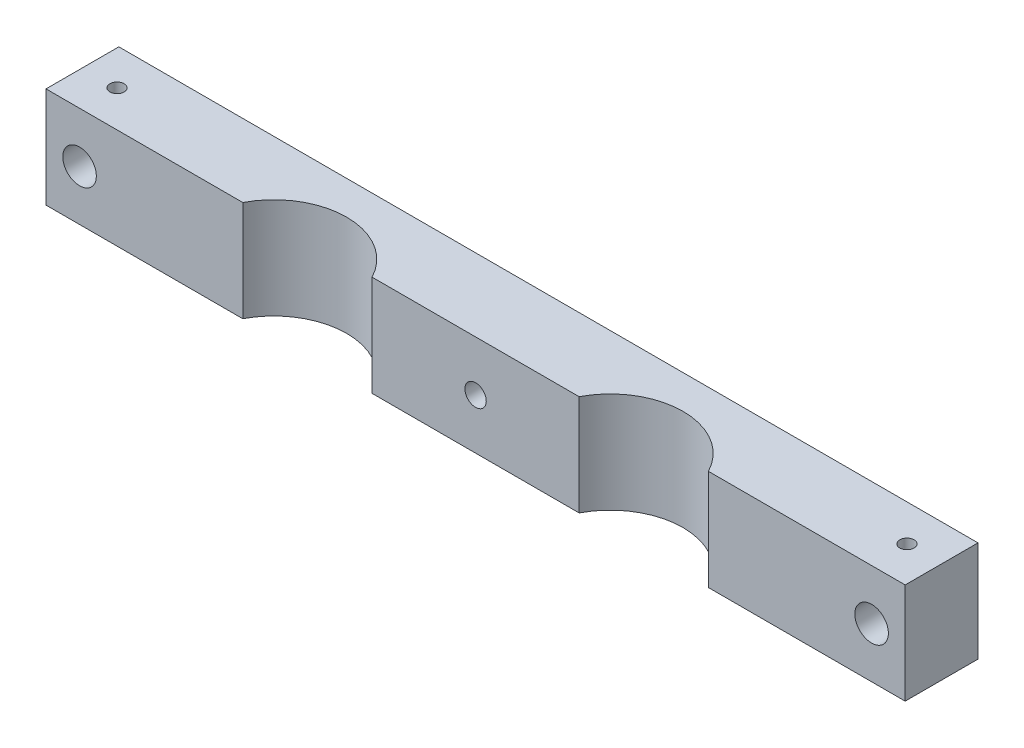
ISO-10303-21;
HEADER;
FILE_DESCRIPTION(('STEP AP214'),'2;1');
FILE_NAME('part.step','',(''),(''),'','','');
FILE_SCHEMA(('AUTOMOTIVE_DESIGN { 1 0 10303 214 1 1 1 1 }'));
ENDSEC;
DATA;
#1=APPLICATION_CONTEXT('core data for automotive mechanical design processes');
#2=APPLICATION_PROTOCOL_DEFINITION('international standard','automotive_design',2000,#1);
#3=PRODUCT_CONTEXT('',#1,'mechanical');
#4=PRODUCT('Part','Part','',(#3));
#5=PRODUCT_RELATED_PRODUCT_CATEGORY('part','',(#4));
#6=PRODUCT_DEFINITION_FORMATION('','',#4);
#7=PRODUCT_DEFINITION_CONTEXT('part definition',#1,'design');
#8=PRODUCT_DEFINITION('design','',#6,#7);
#9=PRODUCT_DEFINITION_SHAPE('','',#8);
#10=(LENGTH_UNIT() NAMED_UNIT(*) SI_UNIT(.MILLI.,.METRE.));
#11=(NAMED_UNIT(*) PLANE_ANGLE_UNIT() SI_UNIT($,.RADIAN.));
#12=(NAMED_UNIT(*) SI_UNIT($,.STERADIAN.) SOLID_ANGLE_UNIT());
#13=UNCERTAINTY_MEASURE_WITH_UNIT(LENGTH_MEASURE(1.E-05),#10,'distance_accuracy_value','');
#14=(GEOMETRIC_REPRESENTATION_CONTEXT(3) GLOBAL_UNCERTAINTY_ASSIGNED_CONTEXT((#13)) GLOBAL_UNIT_ASSIGNED_CONTEXT((#10,
#11,#12)) REPRESENTATION_CONTEXT('',''));
#15=CARTESIAN_POINT('',(0.,0.,0.));
#16=DIRECTION('',(0.,0.,1.));
#17=DIRECTION('',(1.,0.,0.));
#18=AXIS2_PLACEMENT_3D('',#15,#16,#17);
#19=CARTESIAN_POINT('',(31.81985,19.05,6.35));
#20=DIRECTION('',(0.,-1.,0.));
#21=DIRECTION('',(0.,0.,-1.));
#22=AXIS2_PLACEMENT_3D('',#19,#20,#21);
#23=CYLINDRICAL_SURFACE('',#22,13.7795);
#24=CARTESIAN_POINT('',(31.81985,0.,6.35));
#25=DIRECTION('',(0.,1.,0.));
#26=DIRECTION('',(0.,0.,1.));
#27=AXIS2_PLACEMENT_3D('',#24,#25,#26);
#28=CIRCLE('',#27,13.7795);
#29=CARTESIAN_POINT('',(44.0490004304265,0.,0.));
#30=VERTEX_POINT('',#29);
#31=CARTESIAN_POINT('',(19.5906995695735,0.,0.));
#32=VERTEX_POINT('',#31);
#33=EDGE_CURVE('E131',#30,#32,#28,.T.);
#34=ORIENTED_EDGE('',*,*,#33,.F.);
#35=DIRECTION('',(0.,-1.,0.));
#36=VECTOR('',#35,1.);
#37=CARTESIAN_POINT('',(44.0490004304265,19.05,0.));
#38=LINE('',#37,#36);
#39=CARTESIAN_POINT('',(44.0490004304265,19.05,0.));
#40=VERTEX_POINT('',#39);
#41=EDGE_CURVE('E11',#40,#30,#38,.T.);
#42=ORIENTED_EDGE('',*,*,#41,.F.);
#43=CARTESIAN_POINT('',(31.81985,19.05,6.35));
#44=DIRECTION('',(0.,1.,0.));
#45=DIRECTION('',(0.,0.,1.));
#46=AXIS2_PLACEMENT_3D('',#43,#44,#45);
#47=CIRCLE('',#46,13.7795);
#48=CARTESIAN_POINT('',(19.5906995695735,19.05,0.));
#49=VERTEX_POINT('',#48);
#50=EDGE_CURVE('E151',#40,#49,#47,.T.);
#51=ORIENTED_EDGE('',*,*,#50,.T.);
#52=DIRECTION('',(0.,-1.,0.));
#53=VECTOR('',#52,1.);
#54=CARTESIAN_POINT('',(19.5906995695735,19.05,0.));
#55=LINE('',#54,#53);
#56=EDGE_CURVE('E87',#49,#32,#55,.T.);
#57=ORIENTED_EDGE('',*,*,#56,.T.);
#58=EDGE_LOOP('',(#34,#42,#51,#57));
#59=FACE_BOUND('',#58,.T.);
#60=ADVANCED_FACE('F37',(#59),#23,.F.);
#61=CARTESIAN_POINT('',(0.,19.05,0.));
#62=DIRECTION('',(0.,0.,-1.));
#63=DIRECTION('',(-1.,0.,0.));
#64=AXIS2_PLACEMENT_3D('',#61,#62,#63);
#65=PLANE('',#64);
#66=CARTESIAN_POINT('',(74.93,9.525,0.));
#67=DIRECTION('',(0.,0.,1.));
#68=DIRECTION('',(1.,0.,0.));
#69=AXIS2_PLACEMENT_3D('',#66,#67,#68);
#70=CIRCLE('',#69,3.175);
#71=CARTESIAN_POINT('',(78.105,9.525,0.));
#72=VERTEX_POINT('',#71);
#73=EDGE_CURVE('E220',#72,#72,#70,.T.);
#74=ORIENTED_EDGE('',*,*,#73,.F.);
#75=EDGE_LOOP('',(#74));
#76=FACE_BOUND('',#75,.T.);
#77=DIRECTION('',(1.,0.,0.));
#78=VECTOR('',#77,1.);
#79=CARTESIAN_POINT('',(0.,0.,0.));
#80=LINE('',#79,#78);
#81=CARTESIAN_POINT('',(81.28,0.,0.));
#82=VERTEX_POINT('',#81);
#83=EDGE_CURVE('E134',#30,#82,#80,.T.);
#84=ORIENTED_EDGE('',*,*,#83,.T.);
#85=DIRECTION('',(0.,-1.,0.));
#86=VECTOR('',#85,1.);
#87=CARTESIAN_POINT('',(81.28,19.05,0.));
#88=LINE('',#87,#86);
#89=CARTESIAN_POINT('',(81.28,19.05,0.));
#90=VERTEX_POINT('',#89);
#91=EDGE_CURVE('E45',#90,#82,#88,.T.);
#92=ORIENTED_EDGE('',*,*,#91,.F.);
#93=DIRECTION('',(1.,0.,0.));
#94=VECTOR('',#93,1.);
#95=CARTESIAN_POINT('',(0.,19.05,0.));
#96=LINE('',#95,#94);
#97=EDGE_CURVE('E177',#40,#90,#96,.T.);
#98=ORIENTED_EDGE('',*,*,#97,.F.);
#99=ORIENTED_EDGE('',*,*,#41,.T.);
#100=EDGE_LOOP('',(#84,#92,#98,#99));
#101=FACE_BOUND('',#100,.T.);
#102=ADVANCED_FACE('F245',(#76,#101),#65,.F.);
#103=CARTESIAN_POINT('',(81.28,19.05,0.));
#104=DIRECTION('',(-1.,0.,0.));
#105=DIRECTION('',(0.,0.,1.));
#106=AXIS2_PLACEMENT_3D('',#103,#104,#105);
#107=PLANE('',#106);
#108=DIRECTION('',(0.,0.,-1.));
#109=VECTOR('',#108,1.);
#110=CARTESIAN_POINT('',(81.28,0.,0.));
#111=LINE('',#110,#109);
#112=CARTESIAN_POINT('',(81.28,0.,-13.7795));
#113=VERTEX_POINT('',#112);
#114=EDGE_CURVE('E137',#82,#113,#111,.T.);
#115=ORIENTED_EDGE('',*,*,#114,.T.);
#116=DIRECTION('',(0.,-1.,0.));
#117=VECTOR('',#116,1.);
#118=CARTESIAN_POINT('',(81.28,19.05,-13.7795));
#119=LINE('',#118,#117);
#120=CARTESIAN_POINT('',(81.28,19.05,-13.7795));
#121=VERTEX_POINT('',#120);
#122=EDGE_CURVE('E157',#121,#113,#119,.T.);
#123=ORIENTED_EDGE('',*,*,#122,.F.);
#124=DIRECTION('',(0.,0.,-1.));
#125=VECTOR('',#124,1.);
#126=CARTESIAN_POINT('',(81.28,19.05,0.));
#127=LINE('',#126,#125);
#128=EDGE_CURVE('E165',#90,#121,#127,.T.);
#129=ORIENTED_EDGE('',*,*,#128,.F.);
#130=ORIENTED_EDGE('',*,*,#91,.T.);
#131=EDGE_LOOP('',(#115,#123,#129,#130));
#132=FACE_BOUND('',#131,.T.);
#133=ADVANCED_FACE('F163',(#132),#107,.F.);
#134=CARTESIAN_POINT('',(0.,19.05,-13.7795));
#135=DIRECTION('',(0.,0.,-1.));
#136=DIRECTION('',(-1.,0.,0.));
#137=AXIS2_PLACEMENT_3D('',#134,#135,#136);
#138=PLANE('',#137);
#139=CARTESIAN_POINT('',(0.,9.525,-13.7795));
#140=DIRECTION('',(0.,0.,-1.));
#141=DIRECTION('',(-1.,0.,0.));
#142=AXIS2_PLACEMENT_3D('',#139,#140,#141);
#143=CIRCLE('',#142,2.0193);
#144=CARTESIAN_POINT('',(-2.01929999999998,9.525,-13.7795));
#145=VERTEX_POINT('',#144);
#146=EDGE_CURVE('E373',#145,#145,#143,.T.);
#147=ORIENTED_EDGE('',*,*,#146,.F.);
#148=EDGE_LOOP('',(#147));
#149=FACE_BOUND('',#148,.T.);
#150=CARTESIAN_POINT('',(74.93,9.525,-13.7795));
#151=DIRECTION('',(0.,0.,1.));
#152=DIRECTION('',(1.,0.,0.));
#153=AXIS2_PLACEMENT_3D('',#150,#151,#152);
#154=CIRCLE('',#153,3.175);
#155=CARTESIAN_POINT('',(78.105,9.525,-13.7795));
#156=VERTEX_POINT('',#155);
#157=EDGE_CURVE('E224',#156,#156,#154,.T.);
#158=ORIENTED_EDGE('',*,*,#157,.T.);
#159=EDGE_LOOP('',(#158));
#160=FACE_BOUND('',#159,.T.);
#161=CARTESIAN_POINT('',(-74.93,9.525,-13.7795));
#162=DIRECTION('',(0.,0.,1.));
#163=DIRECTION('',(1.,0.,0.));
#164=AXIS2_PLACEMENT_3D('',#161,#162,#163);
#165=CIRCLE('',#164,3.175);
#166=CARTESIAN_POINT('',(-71.755,9.525,-13.7795));
#167=VERTEX_POINT('',#166);
#168=EDGE_CURVE('E135',#167,#167,#165,.T.);
#169=ORIENTED_EDGE('',*,*,#168,.T.);
#170=EDGE_LOOP('',(#169));
#171=FACE_BOUND('',#170,.T.);
#172=DIRECTION('',(1.,0.,0.));
#173=VECTOR('',#172,1.);
#174=CARTESIAN_POINT('',(0.,0.,-13.7795));
#175=LINE('',#174,#173);
#176=CARTESIAN_POINT('',(-81.28,0.,-13.7795));
#177=VERTEX_POINT('',#176);
#178=EDGE_CURVE('E140',#177,#113,#175,.T.);
#179=ORIENTED_EDGE('',*,*,#178,.F.);
#180=DIRECTION('',(0.,-1.,0.));
#181=VECTOR('',#180,1.);
#182=CARTESIAN_POINT('',(-81.28,19.05,-13.7795));
#183=LINE('',#182,#181);
#184=CARTESIAN_POINT('',(-81.28,19.05,-13.7795));
#185=VERTEX_POINT('',#184);
#186=EDGE_CURVE('E155',#185,#177,#183,.T.);
#187=ORIENTED_EDGE('',*,*,#186,.F.);
#188=DIRECTION('',(1.,0.,0.));
#189=VECTOR('',#188,1.);
#190=CARTESIAN_POINT('',(0.,19.05,-13.7795));
#191=LINE('',#190,#189);
#192=EDGE_CURVE('E175',#185,#121,#191,.T.);
#193=ORIENTED_EDGE('',*,*,#192,.T.);
#194=ORIENTED_EDGE('',*,*,#122,.T.);
#195=EDGE_LOOP('',(#179,#187,#193,#194));
#196=FACE_BOUND('',#195,.T.);
#197=ADVANCED_FACE('F173',(#149,#160,#171,#196),#138,.T.);
#198=CARTESIAN_POINT('',(-81.28,19.05,0.));
#199=DIRECTION('',(-1.,0.,0.));
#200=DIRECTION('',(0.,0.,1.));
#201=AXIS2_PLACEMENT_3D('',#198,#199,#200);
#202=PLANE('',#201);
#203=DIRECTION('',(0.,0.,-1.));
#204=VECTOR('',#203,1.);
#205=CARTESIAN_POINT('',(-81.28,0.,0.));
#206=LINE('',#205,#204);
#207=CARTESIAN_POINT('',(-81.28,0.,0.));
#208=VERTEX_POINT('',#207);
#209=EDGE_CURVE('E143',#208,#177,#206,.T.);
#210=ORIENTED_EDGE('',*,*,#209,.F.);
#211=DIRECTION('',(0.,-1.,0.));
#212=VECTOR('',#211,1.);
#213=CARTESIAN_POINT('',(-81.28,19.05,0.));
#214=LINE('',#213,#212);
#215=CARTESIAN_POINT('',(-81.28,19.05,0.));
#216=VERTEX_POINT('',#215);
#217=EDGE_CURVE('E117',#216,#208,#214,.T.);
#218=ORIENTED_EDGE('',*,*,#217,.F.);
#219=DIRECTION('',(0.,0.,-1.));
#220=VECTOR('',#219,1.);
#221=CARTESIAN_POINT('',(-81.28,19.05,0.));
#222=LINE('',#221,#220);
#223=EDGE_CURVE('E124',#216,#185,#222,.T.);
#224=ORIENTED_EDGE('',*,*,#223,.T.);
#225=ORIENTED_EDGE('',*,*,#186,.T.);
#226=EDGE_LOOP('',(#210,#218,#224,#225));
#227=FACE_BOUND('',#226,.T.);
#228=ADVANCED_FACE('F258',(#227),#202,.T.);
#229=CARTESIAN_POINT('',(0.,19.05,0.));
#230=DIRECTION('',(0.,0.,1.));
#231=DIRECTION('',(1.,0.,0.));
#232=AXIS2_PLACEMENT_3D('',#229,#230,#231);
#233=PLANE('',#232);
#234=CARTESIAN_POINT('',(-74.93,9.525,0.));
#235=DIRECTION('',(0.,0.,1.));
#236=DIRECTION('',(1.,0.,0.));
#237=AXIS2_PLACEMENT_3D('',#234,#235,#236);
#238=CIRCLE('',#237,3.175);
#239=CARTESIAN_POINT('',(-71.755,9.525,0.));
#240=VERTEX_POINT('',#239);
#241=EDGE_CURVE('E184',#240,#240,#238,.T.);
#242=ORIENTED_EDGE('',*,*,#241,.F.);
#243=EDGE_LOOP('',(#242));
#244=FACE_BOUND('',#243,.T.);
#245=DIRECTION('',(-1.,0.,0.));
#246=VECTOR('',#245,1.);
#247=CARTESIAN_POINT('',(0.,0.,0.));
#248=LINE('',#247,#246);
#249=CARTESIAN_POINT('',(-44.0490004304265,0.,0.));
#250=VERTEX_POINT('',#249);
#251=EDGE_CURVE('E112',#250,#208,#248,.T.);
#252=ORIENTED_EDGE('',*,*,#251,.F.);
#253=DIRECTION('',(0.,-1.,0.));
#254=VECTOR('',#253,1.);
#255=CARTESIAN_POINT('',(-44.0490004304265,19.05,0.));
#256=LINE('',#255,#254);
#257=CARTESIAN_POINT('',(-44.0490004304265,19.05,0.));
#258=VERTEX_POINT('',#257);
#259=EDGE_CURVE('E107',#258,#250,#256,.T.);
#260=ORIENTED_EDGE('',*,*,#259,.F.);
#261=DIRECTION('',(-1.,0.,0.));
#262=VECTOR('',#261,1.);
#263=CARTESIAN_POINT('',(0.,19.05,0.));
#264=LINE('',#263,#262);
#265=EDGE_CURVE('E110',#258,#216,#264,.T.);
#266=ORIENTED_EDGE('',*,*,#265,.T.);
#267=ORIENTED_EDGE('',*,*,#217,.T.);
#268=EDGE_LOOP('',(#252,#260,#266,#267));
#269=FACE_BOUND('',#268,.T.);
#270=ADVANCED_FACE('F109',(#244,#269),#233,.T.);
#271=CARTESIAN_POINT('',(-31.81985,19.05,6.35));
#272=DIRECTION('',(0.,-1.,0.));
#273=DIRECTION('',(0.,0.,-1.));
#274=AXIS2_PLACEMENT_3D('',#271,#272,#273);
#275=CYLINDRICAL_SURFACE('',#274,13.7795);
#276=CARTESIAN_POINT('',(-31.81985,0.,6.35));
#277=DIRECTION('',(0.,1.,0.));
#278=DIRECTION('',(0.,0.,1.));
#279=AXIS2_PLACEMENT_3D('',#276,#277,#278);
#280=CIRCLE('',#279,13.7795);
#281=CARTESIAN_POINT('',(-19.5906995695735,0.,0.));
#282=VERTEX_POINT('',#281);
#283=EDGE_CURVE('E147',#282,#250,#280,.T.);
#284=ORIENTED_EDGE('',*,*,#283,.F.);
#285=DIRECTION('',(0.,-1.,0.));
#286=VECTOR('',#285,1.);
#287=CARTESIAN_POINT('',(-19.5906995695735,19.05,0.));
#288=LINE('',#287,#286);
#289=CARTESIAN_POINT('',(-19.5906995695735,19.05,0.));
#290=VERTEX_POINT('',#289);
#291=EDGE_CURVE('E80',#290,#282,#288,.T.);
#292=ORIENTED_EDGE('',*,*,#291,.F.);
#293=CARTESIAN_POINT('',(-31.81985,19.05,6.35));
#294=DIRECTION('',(0.,1.,0.));
#295=DIRECTION('',(0.,0.,1.));
#296=AXIS2_PLACEMENT_3D('',#293,#294,#295);
#297=CIRCLE('',#296,13.7795);
#298=EDGE_CURVE('E121',#290,#258,#297,.T.);
#299=ORIENTED_EDGE('',*,*,#298,.T.);
#300=ORIENTED_EDGE('',*,*,#259,.T.);
#301=EDGE_LOOP('',(#284,#292,#299,#300));
#302=FACE_BOUND('',#301,.T.);
#303=ADVANCED_FACE('F126',(#302),#275,.F.);
#304=CARTESIAN_POINT('',(0.,19.05,0.));
#305=DIRECTION('',(0.,0.,-1.));
#306=DIRECTION('',(-1.,0.,0.));
#307=AXIS2_PLACEMENT_3D('',#304,#305,#306);
#308=PLANE('',#307);
#309=CARTESIAN_POINT('',(0.,9.525,0.));
#310=DIRECTION('',(0.,0.,1.));
#311=DIRECTION('',(1.,0.,0.));
#312=AXIS2_PLACEMENT_3D('',#309,#310,#311);
#313=CIRCLE('',#312,2.0193);
#314=CARTESIAN_POINT('',(2.01930000000001,9.525,0.));
#315=VERTEX_POINT('',#314);
#316=EDGE_CURVE('E375',#315,#315,#313,.T.);
#317=ORIENTED_EDGE('',*,*,#316,.F.);
#318=EDGE_LOOP('',(#317));
#319=FACE_BOUND('',#318,.T.);
#320=DIRECTION('',(1.,0.,0.));
#321=VECTOR('',#320,1.);
#322=CARTESIAN_POINT('',(0.,0.,0.));
#323=LINE('',#322,#321);
#324=EDGE_CURVE('E149',#282,#32,#323,.T.);
#325=ORIENTED_EDGE('',*,*,#324,.T.);
#326=ORIENTED_EDGE('',*,*,#56,.F.);
#327=DIRECTION('',(1.,0.,0.));
#328=VECTOR('',#327,1.);
#329=CARTESIAN_POINT('',(0.,19.05,0.));
#330=LINE('',#329,#328);
#331=EDGE_CURVE('E53',#290,#49,#330,.T.);
#332=ORIENTED_EDGE('',*,*,#331,.F.);
#333=ORIENTED_EDGE('',*,*,#291,.T.);
#334=EDGE_LOOP('',(#325,#326,#332,#333));
#335=FACE_BOUND('',#334,.T.);
#336=ADVANCED_FACE('F233',(#319,#335),#308,.F.);
#337=CARTESIAN_POINT('',(0.,19.05,0.));
#338=DIRECTION('',(0.,1.,0.));
#339=DIRECTION('',(0.,0.,1.));
#340=AXIS2_PLACEMENT_3D('',#337,#338,#339);
#341=PLANE('',#340);
#342=CARTESIAN_POINT('',(74.72934,19.05,-6.88975));
#343=DIRECTION('',(0.,1.,0.));
#344=DIRECTION('',(0.,0.,1.));
#345=AXIS2_PLACEMENT_3D('',#342,#343,#344);
#346=CIRCLE('',#345,1.35254999999999);
#347=CARTESIAN_POINT('',(74.72934,19.05,-5.5372));
#348=VERTEX_POINT('',#347);
#349=EDGE_CURVE('E221',#348,#348,#346,.T.);
#350=ORIENTED_EDGE('',*,*,#349,.F.);
#351=EDGE_LOOP('',(#350));
#352=FACE_BOUND('',#351,.T.);
#353=CARTESIAN_POINT('',(-74.72934,19.05,-6.88975));
#354=DIRECTION('',(0.,1.,0.));
#355=DIRECTION('',(0.,0.,1.));
#356=AXIS2_PLACEMENT_3D('',#353,#354,#355);
#357=CIRCLE('',#356,1.35254999999999);
#358=CARTESIAN_POINT('',(-74.72934,19.05,-5.5372));
#359=VERTEX_POINT('',#358);
#360=EDGE_CURVE('E194',#359,#359,#357,.T.);
#361=ORIENTED_EDGE('',*,*,#360,.F.);
#362=EDGE_LOOP('',(#361));
#363=FACE_BOUND('',#362,.T.);
#364=ORIENTED_EDGE('',*,*,#50,.F.);
#365=ORIENTED_EDGE('',*,*,#97,.T.);
#366=ORIENTED_EDGE('',*,*,#128,.T.);
#367=ORIENTED_EDGE('',*,*,#192,.F.);
#368=ORIENTED_EDGE('',*,*,#223,.F.);
#369=ORIENTED_EDGE('',*,*,#265,.F.);
#370=ORIENTED_EDGE('',*,*,#298,.F.);
#371=ORIENTED_EDGE('',*,*,#331,.T.);
#372=EDGE_LOOP('',(#364,#365,#366,#367,#368,#369,#370,#371));
#373=FACE_BOUND('',#372,.T.);
#374=ADVANCED_FACE('F120',(#352,#363,#373),#341,.T.);
#375=CARTESIAN_POINT('',(0.,0.,0.));
#376=DIRECTION('',(0.,1.,0.));
#377=DIRECTION('',(0.,0.,1.));
#378=AXIS2_PLACEMENT_3D('',#375,#376,#377);
#379=PLANE('',#378);
#380=ORIENTED_EDGE('',*,*,#33,.T.);
#381=ORIENTED_EDGE('',*,*,#324,.F.);
#382=ORIENTED_EDGE('',*,*,#283,.T.);
#383=ORIENTED_EDGE('',*,*,#251,.T.);
#384=ORIENTED_EDGE('',*,*,#209,.T.);
#385=ORIENTED_EDGE('',*,*,#178,.T.);
#386=ORIENTED_EDGE('',*,*,#114,.F.);
#387=ORIENTED_EDGE('',*,*,#83,.F.);
#388=EDGE_LOOP('',(#380,#381,#382,#383,#384,#385,#386,#387));
#389=FACE_BOUND('',#388,.T.);
#390=ADVANCED_FACE('F169',(#389),#379,.F.);
#391=CARTESIAN_POINT('',(-74.93,9.525,0.));
#392=DIRECTION('',(0.,0.,1.));
#393=DIRECTION('',(1.,0.,0.));
#394=AXIS2_PLACEMENT_3D('',#391,#392,#393);
#395=CYLINDRICAL_SURFACE('',#394,3.175);
#396=CARTESIAN_POINT('',(-74.72934,12.693652799598,-5.5372));
#397=CARTESIAN_POINT('',(-74.6558864939555,12.6889952366404,-5.53720781124177));
#398=CARTESIAN_POINT('',(-74.5824767865573,12.6817577365838,-5.54322001866827));
#399=CARTESIAN_POINT('',(-74.4380837937419,12.6625128037846,-5.56689474812011));
#400=CARTESIAN_POINT('',(-74.3671078687073,12.6504920871925,-5.58458980650599));
#401=CARTESIAN_POINT('',(-74.2298864754565,12.6226354874719,-5.6307214423366));
#402=CARTESIAN_POINT('',(-74.1636226875503,12.6068155599087,-5.65911337247547));
#403=CARTESIAN_POINT('',(-74.0369929424087,12.5725354260554,-5.72563402073239));
#404=CARTESIAN_POINT('',(-73.9766250777073,12.5540760784722,-5.76375957527753));
#405=CARTESIAN_POINT('',(-73.8594627096782,12.5147520580263,-5.85130552211839));
#406=CARTESIAN_POINT('',(-73.8030963932242,12.4938095836234,-5.90126414607644));
#407=CARTESIAN_POINT('',(-73.6993033875483,12.4523095820841,-6.0099388433828));
#408=CARTESIAN_POINT('',(-73.6518828807581,12.431752329947,-6.06866092330341));
#409=CARTESIAN_POINT('',(-73.5651528996714,12.392089131635,-6.19670247899557));
#410=CARTESIAN_POINT('',(-73.5263322455495,12.3730975754147,-6.26639146255846));
#411=CARTESIAN_POINT('',(-73.4612710655366,12.3401026892642,-6.41249687361902));
#412=CARTESIAN_POINT('',(-73.435018449554,12.3260945687586,-6.48890675168942));
#413=CARTESIAN_POINT('',(-73.3980115131675,12.3060156614779,-6.63977004192748));
#414=CARTESIAN_POINT('',(-73.3861765421155,12.2993951018752,-6.71388288494719));
#415=CARTESIAN_POINT('',(-73.3749785571233,12.2931368349477,-6.86331675909214));
#416=CARTESIAN_POINT('',(-73.3756064869189,12.2934940571601,-6.93863687317916));
#417=CARTESIAN_POINT('',(-73.3885470482362,12.3007135447077,-7.07992843764766));
#418=CARTESIAN_POINT('',(-73.3996305469645,12.3068914503222,-7.14605364566761));
#419=CARTESIAN_POINT('',(-73.43121529512,12.3240336605659,-7.27536040576378));
#420=CARTESIAN_POINT('',(-73.4517190029147,12.3349992145781,-7.33854118469647));
#421=CARTESIAN_POINT('',(-73.5022342398965,12.3610075871045,-7.46268049656588));
#422=CARTESIAN_POINT('',(-73.5325476910684,12.3761773246028,-7.523488534697));
#423=CARTESIAN_POINT('',(-73.6015407100085,12.4089692257014,-7.63942749541026));
#424=CARTESIAN_POINT('',(-73.6402240474937,12.4265924930686,-7.69455584334483));
#425=CARTESIAN_POINT('',(-73.7301983459534,12.4650282202263,-7.80448180258919));
#426=CARTESIAN_POINT('',(-73.7824426314069,12.4859703891704,-7.85845616012501));
#427=CARTESIAN_POINT('',(-73.8952787966509,12.5272636525598,-7.95715596283116));
#428=CARTESIAN_POINT('',(-73.9558743761499,12.5476144801698,-8.00187728672741));
#429=CARTESIAN_POINT('',(-74.0873572882021,12.5869448970234,-8.08285266891769));
#430=CARTESIAN_POINT('',(-74.1586031079349,12.6058086793049,-8.118585394914));
#431=CARTESIAN_POINT('',(-74.3071405936407,12.6392336442993,-8.17719033098181));
#432=CARTESIAN_POINT('',(-74.3844287024519,12.6537973347556,-8.20007004377674));
#433=CARTESIAN_POINT('',(-74.5374412069776,12.6765242782167,-8.23073704771311));
#434=CARTESIAN_POINT('',(-74.6129317654279,12.6850467151207,-8.23942129893774));
#435=CARTESIAN_POINT('',(-74.7647050496857,12.6966059732541,-8.24396442694698));
#436=CARTESIAN_POINT('',(-74.8409873940916,12.699645322616,-8.23982921689876));
#437=CARTESIAN_POINT('',(-74.9863600292514,12.7002728852609,-8.21953629577368));
#438=CARTESIAN_POINT('',(-75.0555742481051,12.6982357605672,-8.20426044952695));
#439=CARTESIAN_POINT('',(-75.1905408647725,12.6900144017865,-8.16319471876395));
#440=CARTESIAN_POINT('',(-75.2562930799905,12.6838299491937,-8.13740428030489));
#441=CARTESIAN_POINT('',(-75.3834015064925,12.6681203052577,-8.07577015790401));
#442=CARTESIAN_POINT('',(-75.4446980775166,12.658557302104,-8.03981364777362));
#443=CARTESIAN_POINT('',(-75.5606850242487,12.6372891220502,-7.95898253065207));
#444=CARTESIAN_POINT('',(-75.6153731252229,12.6255832109966,-7.91410486684727));
#445=CARTESIAN_POINT('',(-75.7203199410211,12.6005678371754,-7.81331935767962));
#446=CARTESIAN_POINT('',(-75.7700601843629,12.5872036045575,-7.75688438205835));
#447=CARTESIAN_POINT('',(-75.8595984425064,12.5612231063016,-7.63643649165242));
#448=CARTESIAN_POINT('',(-75.8993939638498,12.5486070288536,-7.57242168227996));
#449=CARTESIAN_POINT('',(-75.9688296203336,12.5254729191126,-7.43657793019333));
#450=CARTESIAN_POINT('',(-75.998181790565,12.5150172940201,-7.3645901909437));
#451=CARTESIAN_POINT('',(-76.0441898336465,12.4981826928368,-7.21622348608254));
#452=CARTESIAN_POINT('',(-76.0608528102302,12.4918014361346,-7.13984700319672));
#453=CARTESIAN_POINT('',(-76.0802412376216,12.4843364513953,-6.98927903243409));
#454=CARTESIAN_POINT('',(-76.0836681564353,12.4829862399739,-6.9151909889914));
#455=CARTESIAN_POINT('',(-76.0783798845782,12.4850433997624,-6.7675244805736));
#456=CARTESIAN_POINT('',(-76.0696664270349,12.4884500918896,-6.69394594436949));
#457=CARTESIAN_POINT('',(-76.0410207841504,12.4993026793924,-6.55223328925561));
#458=CARTESIAN_POINT('',(-76.0215214273953,12.5065923599291,-6.48399847373091));
#459=CARTESIAN_POINT('',(-75.9722874200646,12.5241567405367,-6.35173898286822));
#460=CARTESIAN_POINT('',(-75.9425500710693,12.5344322274628,-6.28771542279169));
#461=CARTESIAN_POINT('',(-75.8720667844896,12.5572542398537,-6.16244706417095));
#462=CARTESIAN_POINT('',(-75.8308739884505,12.5698840320926,-6.10146912835867));
#463=CARTESIAN_POINT('',(-75.7392117056398,12.5955151304721,-5.98701579006003));
#464=CARTESIAN_POINT('',(-75.6887399196594,12.6085165280155,-5.93354225286616));
#465=CARTESIAN_POINT('',(-75.5768974214772,12.6339539801252,-5.83287940307369));
#466=CARTESIAN_POINT('',(-75.5151079652226,12.6463292713146,-5.78613794024387));
#467=CARTESIAN_POINT('',(-75.3840275639708,12.6680699294399,-5.70367782923925));
#468=CARTESIAN_POINT('',(-75.3147343451074,12.6774343805692,-5.66796253502295));
#469=CARTESIAN_POINT('',(-75.1727878594208,12.6914832741603,-5.60972715435632));
#470=CARTESIAN_POINT('',(-75.1002955268054,12.6962984624795,-5.5868466477847));
#471=CARTESIAN_POINT('',(-74.9524803248074,12.7007746960651,-5.55359740623377));
#472=CARTESIAN_POINT('',(-74.8771665054577,12.7004510127775,-5.54319169835329));
#473=CARTESIAN_POINT('',(-74.777622640359,12.6964353948935,-5.53784332304565));
#474=CARTESIAN_POINT('',(-74.7534789551173,12.6951834100377,-5.53719743299913));
#475=CARTESIAN_POINT('',(-74.72934,12.693652799598,-5.5372));
#476=B_SPLINE_CURVE_WITH_KNOTS('',3,(#396,#397,#398,#399,#400,#401,#402,#403,#404,#405,#406,
#407,#408,#409,#410,#411,#412,#413,#414,#415,#416,#417,#418,#419,#420,#421,#422,#423,#424,#425,
#426,#427,#428,#429,#430,#431,#432,#433,#434,#435,#436,#437,#438,#439,#440,#441,#442,#443,#444,
#445,#446,#447,#448,#449,#450,#451,#452,#453,#454,#455,#456,#457,#458,#459,#460,#461,#462,#463,
#464,#465,#466,#467,#468,#469,#470,#471,#472,#473,#474,#475),.UNSPECIFIED.,.T.,.F.,(4,2,2,2,2,2,
2,2,2,2,2,2,2,2,2,2,2,2,2,2,2,2,2,2,2,2,2,2,2,2,2,2,2,2,2,2,2,2,2,4),(0.,0.220734497470515,
0.44208634116852,0.662524347182406,0.882890798567808,1.11640700847243,1.35008401445503,
1.59479677751166,1.83927365851883,2.06400153696934,2.28856612113395,2.48964043804066,
2.690767258623,2.89879089496261,3.10690841891856,3.33984175439794,3.5728786154227,
3.81731723815895,4.06161302542801,4.28977468044143,4.51783110816003,4.72956132875017,
4.94130270541604,5.15549309177916,5.36975699690462,5.59793884669261,5.82617785166181,
6.06029544712343,6.29428188104807,6.51568255936774,6.73705163435879,6.95012173720259,
7.163248041817,7.38626555839028,7.60933841036338,7.84356403607052,8.07786083888217,
8.30519846480782,8.53186062673722,8.60440039255938),.UNSPECIFIED.);
#477=CARTESIAN_POINT('',(-74.72934,12.693652799598,-5.5372));
#478=VERTEX_POINT('',#477);
#479=EDGE_CURVE('E187',#478,#478,#476,.T.);
#480=ORIENTED_EDGE('',*,*,#479,.T.);
#481=EDGE_LOOP('',(#480));
#482=FACE_BOUND('',#481,.T.);
#483=ORIENTED_EDGE('',*,*,#168,.F.);
#484=EDGE_LOOP('',(#483));
#485=FACE_BOUND('',#484,.T.);
#486=ORIENTED_EDGE('',*,*,#241,.T.);
#487=EDGE_LOOP('',(#486));
#488=FACE_BOUND('',#487,.T.);
#489=ADVANCED_FACE('F203',(#482,#485,#488),#395,.F.);
#490=CARTESIAN_POINT('',(-74.72934,19.05,-6.88975));
#491=DIRECTION('',(0.,1.,0.));
#492=DIRECTION('',(0.,0.,1.));
#493=AXIS2_PLACEMENT_3D('',#490,#491,#492);
#494=CYLINDRICAL_SURFACE('',#493,1.35254999999999);
#495=ORIENTED_EDGE('',*,*,#479,.F.);
#496=EDGE_LOOP('',(#495));
#497=FACE_BOUND('',#496,.T.);
#498=ORIENTED_EDGE('',*,*,#360,.T.);
#499=EDGE_LOOP('',(#498));
#500=FACE_BOUND('',#499,.T.);
#501=ADVANCED_FACE('F198',(#497,#500),#494,.F.);
#502=CARTESIAN_POINT('',(74.93,9.525,0.));
#503=DIRECTION('',(0.,0.,1.));
#504=DIRECTION('',(1.,0.,0.));
#505=AXIS2_PLACEMENT_3D('',#502,#503,#504);
#506=CYLINDRICAL_SURFACE('',#505,3.175);
#507=CARTESIAN_POINT('',(74.72934,12.693652799598,-5.5372));
#508=CARTESIAN_POINT('',(74.8006794250257,12.6981642055928,-5.53720823593017));
#509=CARTESIAN_POINT('',(74.8722647117013,12.7002581355199,-5.5428756844376));
#510=CARTESIAN_POINT('',(75.0137238228996,12.6996886918368,-5.56548719638122));
#511=CARTESIAN_POINT('',(75.083593376064,12.6970144674832,-5.5824569250029));
#512=CARTESIAN_POINT('',(75.2193248654594,12.6875197277015,-5.62705711177347));
#513=CARTESIAN_POINT('',(75.2851971318976,12.6807104485218,-5.65465860599085));
#514=CARTESIAN_POINT('',(75.4114416321124,12.6639329548358,-5.71963368848083));
#515=CARTESIAN_POINT('',(75.4718151414468,12.6539654753588,-5.75700500260378));
#516=CARTESIAN_POINT('',(75.5878123665866,12.6316899313081,-5.84200433323685));
#517=CARTESIAN_POINT('',(75.6431872259158,12.6193105913843,-5.88995284146787));
#518=CARTESIAN_POINT('',(75.74544849077,12.5939493293585,-5.99406913310168));
#519=CARTESIAN_POINT('',(75.792331076348,12.5809671393683,-6.05024059486747));
#520=CARTESIAN_POINT('',(75.8788080436526,12.5552698876804,-6.17278713097182));
#521=CARTESIAN_POINT('',(75.9178714711854,12.5426071991047,-6.23954963247599));
#522=CARTESIAN_POINT('',(75.9841867260384,12.5200875641973,-6.37914504464759));
#523=CARTESIAN_POINT('',(76.0114417601474,12.5102298563707,-6.45197630081775));
#524=CARTESIAN_POINT('',(76.0526115111183,12.4949904761944,-6.59978743071646));
#525=CARTESIAN_POINT('',(76.0668449155174,12.4895023277838,-6.67466699623948));
#526=CARTESIAN_POINT('',(76.0825194606062,12.4834454812643,-6.82593588506088));
#527=CARTESIAN_POINT('',(76.0839662957058,12.4828745932904,-6.90232452111281));
#528=CARTESIAN_POINT('',(76.0743192486097,12.4866173175219,-7.04955896713871));
#529=CARTESIAN_POINT('',(76.0639711462479,12.4906404813626,-7.1204627727515));
#530=CARTESIAN_POINT('',(76.0323360303722,12.5025430281108,-7.25944449548666));
#531=CARTESIAN_POINT('',(76.0110473224727,12.5104230083194,-7.32752197312645));
#532=CARTESIAN_POINT('',(75.9578844426991,12.5291434876187,-7.46004701046243));
#533=CARTESIAN_POINT('',(75.925870436616,12.5400227399914,-7.52443271601635));
#534=CARTESIAN_POINT('',(75.8522273903174,12.5633565413735,-7.6471401831275));
#535=CARTESIAN_POINT('',(75.8105950104684,12.5758116368564,-7.70545982824056));
#536=CARTESIAN_POINT('',(75.7157500637114,12.6016513484109,-7.81827280458658));
#537=CARTESIAN_POINT('',(75.6619704041857,12.6150448060083,-7.87228867814883));
#538=CARTESIAN_POINT('',(75.5458838045174,12.6402584928877,-7.97069274835232));
#539=CARTESIAN_POINT('',(75.4835761533987,12.6520785908369,-8.01508014147162));
#540=CARTESIAN_POINT('',(75.3515784746545,12.6725985740529,-8.0931284622795));
#541=CARTESIAN_POINT('',(75.2818482021091,12.6812801974694,-8.1267264874034));
#542=CARTESIAN_POINT('',(75.137314385905,12.6940527753575,-8.18161498968989));
#543=CARTESIAN_POINT('',(75.0625136350118,12.6981462355005,-8.20291218145623));
#544=CARTESIAN_POINT('',(74.9150546099217,12.7007670610707,-8.23145962248598));
#545=CARTESIAN_POINT('',(74.8425559883563,12.6996272739293,-8.23950676773634));
#546=CARTESIAN_POINT('',(74.6974705967718,12.6923059498589,-8.24386984628505));
#547=CARTESIAN_POINT('',(74.6248838437787,12.6861252676267,-8.24018776799551));
#548=CARTESIAN_POINT('',(74.4841731371181,12.669316017496,-8.22172442580098));
#549=CARTESIAN_POINT('',(74.4159809953718,12.6588415000945,-8.2073147048521));
#550=CARTESIAN_POINT('',(74.2832318720537,12.6341604408591,-8.16848567951009));
#551=CARTESIAN_POINT('',(74.218675578291,12.6199531957495,-8.1440644883897));
#552=CARTESIAN_POINT('',(74.0914261630261,12.5879949987038,-8.08458762297267));
#553=CARTESIAN_POINT('',(74.028991322219,12.5701014334188,-8.04905762044214));
#554=CARTESIAN_POINT('',(73.9108291468761,12.5326178377699,-7.96888642416126));
#555=CARTESIAN_POINT('',(73.8551053136926,12.5130269309331,-7.92424050679903));
#556=CARTESIAN_POINT('',(73.7470122699412,12.471995277504,-7.82268869101131));
#557=CARTESIAN_POINT('',(73.6953189662114,12.4505374834337,-7.76506762759881));
#558=CARTESIAN_POINT('',(73.6022210343609,12.4094796223195,-7.64140499470143));
#559=CARTESIAN_POINT('',(73.560819465626,12.3898801087481,-7.57536093014915));
#560=CARTESIAN_POINT('',(73.4894273946377,12.3546600331668,-7.43581109647081));
#561=CARTESIAN_POINT('',(73.4595065169191,12.3390639328459,-7.3622631208939));
#562=CARTESIAN_POINT('',(73.4128783340636,12.3142079396117,-7.21010727343411));
#563=CARTESIAN_POINT('',(73.3961532665066,12.3049395314853,-7.13150635789506));
#564=CARTESIAN_POINT('',(73.3779856207438,12.294831946798,-6.98098663289114));
#565=CARTESIAN_POINT('',(73.3750439826913,12.293166490051,-6.90930277056081));
#566=CARTESIAN_POINT('',(73.380523677888,12.2962377964807,-6.76651650953945));
#567=CARTESIAN_POINT('',(73.388943103433,12.300973484803,-6.6954140152442));
#568=CARTESIAN_POINT('',(73.4157546657183,12.3156799719525,-6.56066902323084));
#569=CARTESIAN_POINT('',(73.4334503815371,12.3252838069323,-6.49684415829974));
#570=CARTESIAN_POINT('',(73.4776324112619,12.3484504776365,-6.37308754762439));
#571=CARTESIAN_POINT('',(73.5041213206863,12.3620144821559,-6.31315695762022));
#572=CARTESIAN_POINT('',(73.5675542169066,12.3930493652403,-6.19362808666891));
#573=CARTESIAN_POINT('',(73.605168615875,12.4107469695752,-6.13444562078598));
#574=CARTESIAN_POINT('',(73.6887780631443,12.4476840021556,-6.02286583795908));
#575=CARTESIAN_POINT('',(73.734777127033,12.4669241666808,-5.97047179278708));
#576=CARTESIAN_POINT('',(73.8397645488677,12.5075347737303,-5.8679854427481));
#577=CARTESIAN_POINT('',(73.8996257051172,12.5289063250612,-5.81878302895458));
#578=CARTESIAN_POINT('',(74.0273695792227,12.5697292873022,-5.7310291140506));
#579=CARTESIAN_POINT('',(74.0952574560147,12.5891794483954,-5.69248451664438));
#580=CARTESIAN_POINT('',(74.2378253404058,12.6245064614263,-5.62721932978826));
#581=CARTESIAN_POINT('',(74.3125381858246,12.6403646060223,-5.60055997265683));
#582=CARTESIAN_POINT('',(74.4661897673672,12.6668992568418,-5.56069033643102));
#583=CARTESIAN_POINT('',(74.545113929186,12.6775924908565,-5.54743648572965));
#584=CARTESIAN_POINT('',(74.6595048740663,12.6886526636136,-5.53854998844557));
#585=CARTESIAN_POINT('',(74.6943929369695,12.6914427959485,-5.53719596546271));
#586=CARTESIAN_POINT('',(74.72934,12.693652799598,-5.5372));
#587=B_SPLINE_CURVE_WITH_KNOTS('',3,(#507,#508,#509,#510,#511,#512,#513,#514,#515,#516,#517,
#518,#519,#520,#521,#522,#523,#524,#525,#526,#527,#528,#529,#530,#531,#532,#533,#534,#535,#536,
#537,#538,#539,#540,#541,#542,#543,#544,#545,#546,#547,#548,#549,#550,#551,#552,#553,#554,#555,
#556,#557,#558,#559,#560,#561,#562,#563,#564,#565,#566,#567,#568,#569,#570,#571,#572,#573,#574,
#575,#576,#577,#578,#579,#580,#581,#582,#583,#584,#585,#586),.UNSPECIFIED.,.T.,.F.,(4,2,2,2,2,2,
2,2,2,2,2,2,2,2,2,2,2,2,2,2,2,2,2,2,2,2,2,2,2,2,2,2,2,2,2,2,2,2,2,4),(0.,0.214340022642968,
0.429168435054978,0.64341568685875,0.857613112037233,1.07951269052659,1.30151183611058,
1.53551118306924,1.76944694326135,1.99749104921068,2.22543359217756,2.43972639241999,
2.65405239046844,2.87128914106694,3.08860143295376,3.31970003822028,3.55081792185817,
3.78325975202256,4.01557457994276,4.2333257568287,4.45104002112337,4.66154552888024,
4.87209072603237,5.0932572953465,5.31453875915521,5.55442406451161,5.79438059463023,
6.03577016666643,6.27683425561386,6.49095723272214,6.70504425963516,6.90497166657476,
7.10495813935578,7.32105752237281,7.53726067304294,7.7772888475332,8.0174721402999,
8.25887893923435,8.49949855310723,8.60449735676409),.UNSPECIFIED.);
#588=CARTESIAN_POINT('',(74.72934,12.693652799598,-5.5372));
#589=VERTEX_POINT('',#588);
#590=EDGE_CURVE('E214',#589,#589,#587,.T.);
#591=ORIENTED_EDGE('',*,*,#590,.T.);
#592=EDGE_LOOP('',(#591));
#593=FACE_BOUND('',#592,.T.);
#594=ORIENTED_EDGE('',*,*,#157,.F.);
#595=EDGE_LOOP('',(#594));
#596=FACE_BOUND('',#595,.T.);
#597=ORIENTED_EDGE('',*,*,#73,.T.);
#598=EDGE_LOOP('',(#597));
#599=FACE_BOUND('',#598,.T.);
#600=ADVANCED_FACE('F202',(#593,#596,#599),#506,.F.);
#601=CARTESIAN_POINT('',(74.72934,19.05,-6.88975));
#602=DIRECTION('',(0.,1.,0.));
#603=DIRECTION('',(0.,0.,1.));
#604=AXIS2_PLACEMENT_3D('',#601,#602,#603);
#605=CYLINDRICAL_SURFACE('',#604,1.35254999999999);
#606=ORIENTED_EDGE('',*,*,#590,.F.);
#607=EDGE_LOOP('',(#606));
#608=FACE_BOUND('',#607,.T.);
#609=ORIENTED_EDGE('',*,*,#349,.T.);
#610=EDGE_LOOP('',(#609));
#611=FACE_BOUND('',#610,.T.);
#612=ADVANCED_FACE('F207',(#608,#611),#605,.F.);
#613=CARTESIAN_POINT('',(0.,9.525,0.));
#614=DIRECTION('',(0.,0.,1.));
#615=DIRECTION('',(1.,0.,0.));
#616=AXIS2_PLACEMENT_3D('',#613,#614,#615);
#617=CYLINDRICAL_SURFACE('',#616,2.0193);
#618=ORIENTED_EDGE('',*,*,#316,.T.);
#619=EDGE_LOOP('',(#618));
#620=FACE_BOUND('',#619,.T.);
#621=ORIENTED_EDGE('',*,*,#146,.T.);
#622=EDGE_LOOP('',(#621));
#623=FACE_BOUND('',#622,.T.);
#624=ADVANCED_FACE('F287',(#620,#623),#617,.F.);
#625=CLOSED_SHELL('',(#60,#102,#133,#197,#228,#270,#303,#336,#374,#390,#489,#501,#600,#612,#624));
#626=MANIFOLD_SOLID_BREP('B2',#625);
#627=ADVANCED_BREP_SHAPE_REPRESENTATION('',(#18,#626),#14);
#628=SHAPE_DEFINITION_REPRESENTATION(#9,#627);
ENDSEC;
END-ISO-10303-21;
